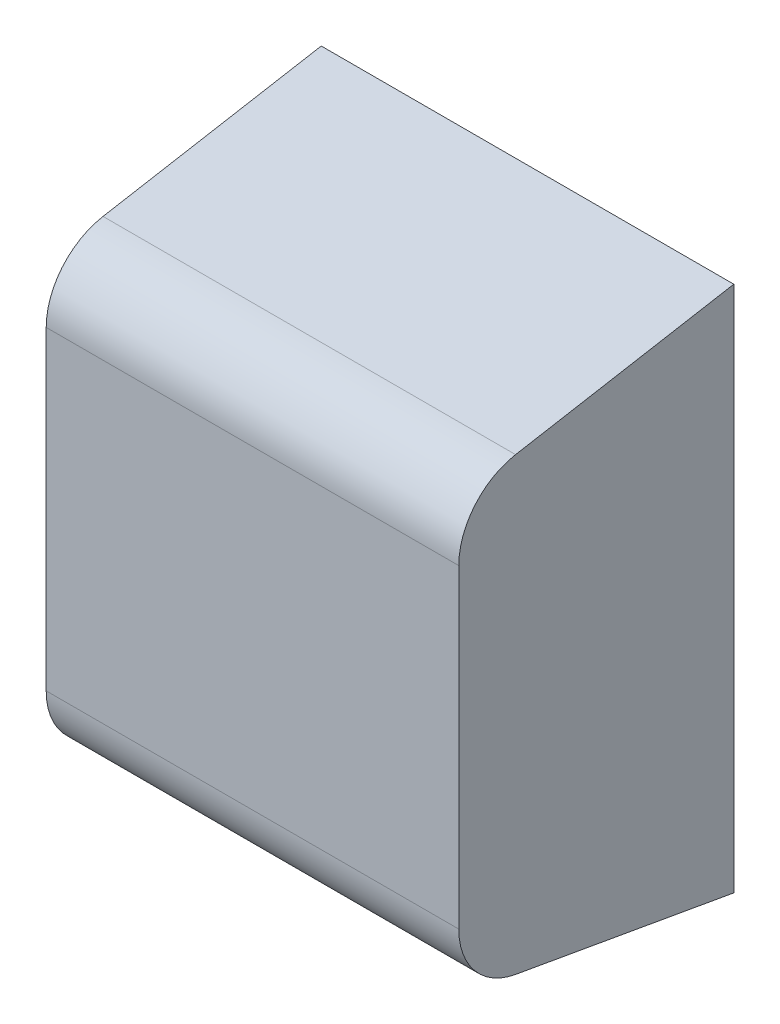
ISO-10303-21;
HEADER;
FILE_DESCRIPTION(('STEP AP214'),'2;1');
FILE_NAME('part.step','',(''),(''),'','','');
FILE_SCHEMA(('AUTOMOTIVE_DESIGN { 1 0 10303 214 1 1 1 1 }'));
ENDSEC;
DATA;
#1=APPLICATION_CONTEXT('core data for automotive mechanical design processes');
#2=APPLICATION_PROTOCOL_DEFINITION('international standard','automotive_design',2000,#1);
#3=PRODUCT_CONTEXT('',#1,'mechanical');
#4=PRODUCT('Part','Part','',(#3));
#5=PRODUCT_RELATED_PRODUCT_CATEGORY('part','',(#4));
#6=PRODUCT_DEFINITION_FORMATION('','',#4);
#7=PRODUCT_DEFINITION_CONTEXT('part definition',#1,'design');
#8=PRODUCT_DEFINITION('design','',#6,#7);
#9=PRODUCT_DEFINITION_SHAPE('','',#8);
#10=(LENGTH_UNIT() NAMED_UNIT(*) SI_UNIT(.MILLI.,.METRE.));
#11=(NAMED_UNIT(*) PLANE_ANGLE_UNIT() SI_UNIT($,.RADIAN.));
#12=(NAMED_UNIT(*) SI_UNIT($,.STERADIAN.) SOLID_ANGLE_UNIT());
#13=UNCERTAINTY_MEASURE_WITH_UNIT(LENGTH_MEASURE(1.E-05),#10,'distance_accuracy_value','');
#14=(GEOMETRIC_REPRESENTATION_CONTEXT(3) GLOBAL_UNCERTAINTY_ASSIGNED_CONTEXT((#13)) GLOBAL_UNIT_ASSIGNED_CONTEXT((#10,
#11,#12)) REPRESENTATION_CONTEXT('',''));
#15=CARTESIAN_POINT('',(0.,0.,0.));
#16=DIRECTION('',(0.,0.,1.));
#17=DIRECTION('',(1.,0.,0.));
#18=AXIS2_PLACEMENT_3D('',#15,#16,#17);
#19=CARTESIAN_POINT('',(-0.45,0.343338669776,0.9));
#20=DIRECTION('',(0.,0.,-1.));
#21=DIRECTION('',(-1.,0.,0.));
#22=AXIS2_PLACEMENT_3D('',#19,#20,#21);
#23=PLANE('',#22);
#24=DIRECTION('',(0.,1.,0.));
#25=VECTOR('',#24,1.);
#26=CARTESIAN_POINT('',(0.449999976158,-0.575,0.9));
#27=LINE('',#26,#25);
#28=CARTESIAN_POINT('',(0.449999976158,-0.343338669776,0.9));
#29=VERTEX_POINT('',#28);
#30=CARTESIAN_POINT('',(0.449999976158,0.343338669776,0.9));
#31=VERTEX_POINT('',#30);
#32=EDGE_CURVE('E136',#29,#31,#27,.T.);
#33=ORIENTED_EDGE('',*,*,#32,.T.);
#34=DIRECTION('',(-1.,0.,0.));
#35=VECTOR('',#34,1.);
#36=CARTESIAN_POINT('',(-0.45,0.343338669776,0.9));
#37=LINE('',#36,#35);
#38=CARTESIAN_POINT('',(-0.45,0.343338669776,0.9));
#39=VERTEX_POINT('',#38);
#40=EDGE_CURVE('E118',#39,#31,#37,.F.);
#41=ORIENTED_EDGE('',*,*,#40,.F.);
#42=DIRECTION('',(0.,1.,0.));
#43=VECTOR('',#42,1.);
#44=CARTESIAN_POINT('',(-0.45,-0.575,0.9));
#45=LINE('',#44,#43);
#46=CARTESIAN_POINT('',(-0.45,-0.343338669776,0.9));
#47=VERTEX_POINT('',#46);
#48=EDGE_CURVE('E124',#47,#39,#45,.T.);
#49=ORIENTED_EDGE('',*,*,#48,.F.);
#50=DIRECTION('',(-1.,0.,0.));
#51=VECTOR('',#50,1.);
#52=CARTESIAN_POINT('',(-0.45,-0.343338669776,0.9));
#53=LINE('',#52,#51);
#54=EDGE_CURVE('E140',#29,#47,#53,.T.);
#55=ORIENTED_EDGE('',*,*,#54,.F.);
#56=EDGE_LOOP('',(#33,#41,#49,#55));
#57=FACE_BOUND('',#56,.T.);
#58=ADVANCED_FACE('F17',(#57),#23,.F.);
#59=CARTESIAN_POINT('',(-0.45,0.343338669776,0.75));
#60=DIRECTION('',(-1.,0.,0.));
#61=DIRECTION('',(0.,-1.,0.));
#62=AXIS2_PLACEMENT_3D('',#59,#60,#61);
#63=CYLINDRICAL_SURFACE('',#62,0.15);
#64=CARTESIAN_POINT('',(-0.45,0.343338669776,0.75));
#65=DIRECTION('',(-1.,0.,0.));
#66=DIRECTION('',(0.,-1.,0.));
#67=AXIS2_PLACEMENT_3D('',#64,#65,#66);
#68=CIRCLE('',#67,0.15);
#69=CARTESIAN_POINT('',(-0.45,0.491059822267207,0.776047285974149));
#70=VERTEX_POINT('',#69);
#71=EDGE_CURVE('E116',#39,#70,#68,.T.);
#72=ORIENTED_EDGE('',*,*,#71,.F.);
#73=ORIENTED_EDGE('',*,*,#40,.T.);
#74=CARTESIAN_POINT('',(0.449999976158,0.343338669776,0.75));
#75=DIRECTION('',(-1.,0.,0.));
#76=DIRECTION('',(0.,-1.,0.));
#77=AXIS2_PLACEMENT_3D('',#74,#75,#76);
#78=CIRCLE('',#77,0.15);
#79=CARTESIAN_POINT('',(0.449999976158,0.491059822267446,0.776047285974118));
#80=VERTEX_POINT('',#79);
#81=EDGE_CURVE('E134',#31,#80,#78,.T.);
#82=ORIENTED_EDGE('',*,*,#81,.T.);
#83=DIRECTION('',(1.,0.,0.));
#84=VECTOR('',#83,1.);
#85=CARTESIAN_POINT('',(-0.45,0.491059822267453,0.77604728597408));
#86=LINE('',#85,#84);
#87=EDGE_CURVE('E121',#80,#70,#86,.F.);
#88=ORIENTED_EDGE('',*,*,#87,.T.);
#89=EDGE_LOOP('',(#72,#73,#82,#88));
#90=FACE_BOUND('',#89,.T.);
#91=ADVANCED_FACE('F106',(#90),#63,.T.);
#92=CARTESIAN_POINT('',(-0.45,-0.343338669776,0.75));
#93=DIRECTION('',(-1.,0.,0.));
#94=DIRECTION('',(0.,-1.,0.));
#95=AXIS2_PLACEMENT_3D('',#92,#93,#94);
#96=CYLINDRICAL_SURFACE('',#95,0.15);
#97=CARTESIAN_POINT('',(-0.45,-0.343338669776,0.75));
#98=DIRECTION('',(-1.,0.,0.));
#99=DIRECTION('',(0.,-1.,0.));
#100=AXIS2_PLACEMENT_3D('',#97,#98,#99);
#101=CIRCLE('',#100,0.15);
#102=CARTESIAN_POINT('',(-0.45,-0.491059822266993,0.776047285974038));
#103=VERTEX_POINT('',#102);
#104=EDGE_CURVE('E127',#103,#47,#101,.T.);
#105=ORIENTED_EDGE('',*,*,#104,.F.);
#106=DIRECTION('',(1.,0.,0.));
#107=VECTOR('',#106,1.);
#108=CARTESIAN_POINT('',(-0.45,-0.491059822267,0.776047285974));
#109=LINE('',#108,#107);
#110=CARTESIAN_POINT('',(0.449999976158,-0.491059822266993,0.776047285974038));
#111=VERTEX_POINT('',#110);
#112=EDGE_CURVE('E83',#103,#111,#109,.T.);
#113=ORIENTED_EDGE('',*,*,#112,.T.);
#114=CARTESIAN_POINT('',(0.449999976158,-0.343338669776,0.75));
#115=DIRECTION('',(-1.,0.,0.));
#116=DIRECTION('',(0.,-1.,0.));
#117=AXIS2_PLACEMENT_3D('',#114,#115,#116);
#118=CIRCLE('',#117,0.15);
#119=EDGE_CURVE('E20',#111,#29,#118,.T.);
#120=ORIENTED_EDGE('',*,*,#119,.T.);
#121=ORIENTED_EDGE('',*,*,#54,.T.);
#122=EDGE_LOOP('',(#105,#113,#120,#121));
#123=FACE_BOUND('',#122,.T.);
#124=ADVANCED_FACE('F104',(#123),#96,.T.);
#125=CARTESIAN_POINT('',(0.449999976158,-0.575,0.3));
#126=DIRECTION('',(-1.,0.,0.));
#127=DIRECTION('',(0.,0.,1.));
#128=AXIS2_PLACEMENT_3D('',#125,#126,#127);
#129=PLANE('',#128);
#130=DIRECTION('',(0.,0.173648573160975,-0.984807683275855));
#131=VECTOR('',#130,1.);
#132=CARTESIAN_POINT('',(0.449999976158,0.575,0.3));
#133=LINE('',#132,#131);
#134=CARTESIAN_POINT('',(0.449999976158,0.575,0.3));
#135=VERTEX_POINT('',#134);
#136=EDGE_CURVE('E135',#135,#80,#133,.F.);
#137=ORIENTED_EDGE('',*,*,#136,.T.);
#138=ORIENTED_EDGE('',*,*,#81,.F.);
#139=ORIENTED_EDGE('',*,*,#32,.F.);
#140=ORIENTED_EDGE('',*,*,#119,.F.);
#141=DIRECTION('',(0.,0.173648573160975,0.984807683275855));
#142=VECTOR('',#141,1.);
#143=CARTESIAN_POINT('',(0.449999976158,-0.491059822267,0.776047285974));
#144=LINE('',#143,#142);
#145=CARTESIAN_POINT('',(0.449999976158,-0.574999999999547,0.29999999999992));
#146=VERTEX_POINT('',#145);
#147=EDGE_CURVE('E79',#111,#146,#144,.F.);
#148=ORIENTED_EDGE('',*,*,#147,.T.);
#149=DIRECTION('',(0.,1.,0.));
#150=VECTOR('',#149,1.);
#151=CARTESIAN_POINT('',(0.449999976158,-0.575,0.3));
#152=LINE('',#151,#150);
#153=EDGE_CURVE('E72',#146,#135,#152,.T.);
#154=ORIENTED_EDGE('',*,*,#153,.T.);
#155=EDGE_LOOP('',(#137,#138,#139,#140,#148,#154));
#156=FACE_BOUND('',#155,.T.);
#157=ADVANCED_FACE('F81',(#156),#129,.F.);
#158=CARTESIAN_POINT('',(-0.45,0.575,0.3));
#159=DIRECTION('',(0.,-0.984807683275855,-0.173648573160975));
#160=DIRECTION('',(0.,0.173648573160975,-0.984807683275855));
#161=AXIS2_PLACEMENT_3D('',#158,#159,#160);
#162=PLANE('',#161);
#163=ORIENTED_EDGE('',*,*,#136,.F.);
#164=DIRECTION('',(1.,0.,0.));
#165=VECTOR('',#164,1.);
#166=CARTESIAN_POINT('',(-0.45,0.575,0.3));
#167=LINE('',#166,#165);
#168=CARTESIAN_POINT('',(-0.45,0.575,0.3));
#169=VERTEX_POINT('',#168);
#170=EDGE_CURVE('E77',#135,#169,#167,.F.);
#171=ORIENTED_EDGE('',*,*,#170,.T.);
#172=DIRECTION('',(0.,0.173648573161911,-0.98480768327569));
#173=VECTOR('',#172,1.);
#174=CARTESIAN_POINT('',(-0.45,0.491059822267,0.776047285974));
#175=LINE('',#174,#173);
#176=EDGE_CURVE('E123',#70,#169,#175,.T.);
#177=ORIENTED_EDGE('',*,*,#176,.F.);
#178=ORIENTED_EDGE('',*,*,#87,.F.);
#179=EDGE_LOOP('',(#163,#171,#177,#178));
#180=FACE_BOUND('',#179,.T.);
#181=ADVANCED_FACE('F95',(#180),#162,.F.);
#182=CARTESIAN_POINT('',(-0.45,-0.575,0.3));
#183=DIRECTION('',(-1.,0.,0.));
#184=DIRECTION('',(0.,0.,1.));
#185=AXIS2_PLACEMENT_3D('',#182,#183,#184);
#186=PLANE('',#185);
#187=ORIENTED_EDGE('',*,*,#71,.T.);
#188=ORIENTED_EDGE('',*,*,#176,.T.);
#189=DIRECTION('',(0.,1.,0.));
#190=VECTOR('',#189,1.);
#191=CARTESIAN_POINT('',(-0.45,-0.575,0.3));
#192=LINE('',#191,#190);
#193=CARTESIAN_POINT('',(-0.45,-0.574999999999774,0.29999999999996));
#194=VERTEX_POINT('',#193);
#195=EDGE_CURVE('E26',#169,#194,#192,.F.);
#196=ORIENTED_EDGE('',*,*,#195,.T.);
#197=DIRECTION('',(0.,0.173648573160975,0.984807683275855));
#198=VECTOR('',#197,1.);
#199=CARTESIAN_POINT('',(-0.45,-0.491059822267,0.776047285974));
#200=LINE('',#199,#198);
#201=EDGE_CURVE('E34',#194,#103,#200,.T.);
#202=ORIENTED_EDGE('',*,*,#201,.T.);
#203=ORIENTED_EDGE('',*,*,#104,.T.);
#204=ORIENTED_EDGE('',*,*,#48,.T.);
#205=EDGE_LOOP('',(#187,#188,#196,#202,#203,#204));
#206=FACE_BOUND('',#205,.T.);
#207=ADVANCED_FACE('F87',(#206),#186,.T.);
#208=CARTESIAN_POINT('',(-0.45,-0.491059822267,0.776047285974));
#209=DIRECTION('',(0.,0.984807683275855,-0.173648573160975));
#210=DIRECTION('',(0.,0.173648573160975,0.984807683275855));
#211=AXIS2_PLACEMENT_3D('',#208,#209,#210);
#212=PLANE('',#211);
#213=ORIENTED_EDGE('',*,*,#147,.F.);
#214=ORIENTED_EDGE('',*,*,#112,.F.);
#215=ORIENTED_EDGE('',*,*,#201,.F.);
#216=DIRECTION('',(1.,0.,0.));
#217=VECTOR('',#216,1.);
#218=CARTESIAN_POINT('',(-0.45,-0.575,0.3));
#219=LINE('',#218,#217);
#220=EDGE_CURVE('E11',#194,#146,#219,.T.);
#221=ORIENTED_EDGE('',*,*,#220,.T.);
#222=EDGE_LOOP('',(#213,#214,#215,#221));
#223=FACE_BOUND('',#222,.T.);
#224=ADVANCED_FACE('F85',(#223),#212,.F.);
#225=CARTESIAN_POINT('',(-0.45,-0.575,0.3));
#226=DIRECTION('',(0.,0.,1.));
#227=DIRECTION('',(1.,0.,0.));
#228=AXIS2_PLACEMENT_3D('',#225,#226,#227);
#229=PLANE('',#228);
#230=ORIENTED_EDGE('',*,*,#195,.F.);
#231=ORIENTED_EDGE('',*,*,#170,.F.);
#232=ORIENTED_EDGE('',*,*,#153,.F.);
#233=ORIENTED_EDGE('',*,*,#220,.F.);
#234=EDGE_LOOP('',(#230,#231,#232,#233));
#235=FACE_BOUND('',#234,.T.);
#236=ADVANCED_FACE('F74',(#235),#229,.F.);
#237=CLOSED_SHELL('',(#58,#91,#124,#157,#181,#207,#224,#236));
#238=MANIFOLD_SOLID_BREP('B1',#237);
#239=ADVANCED_BREP_SHAPE_REPRESENTATION('',(#18,#238),#14);
#240=SHAPE_DEFINITION_REPRESENTATION(#9,#239);
ENDSEC;
END-ISO-10303-21;
